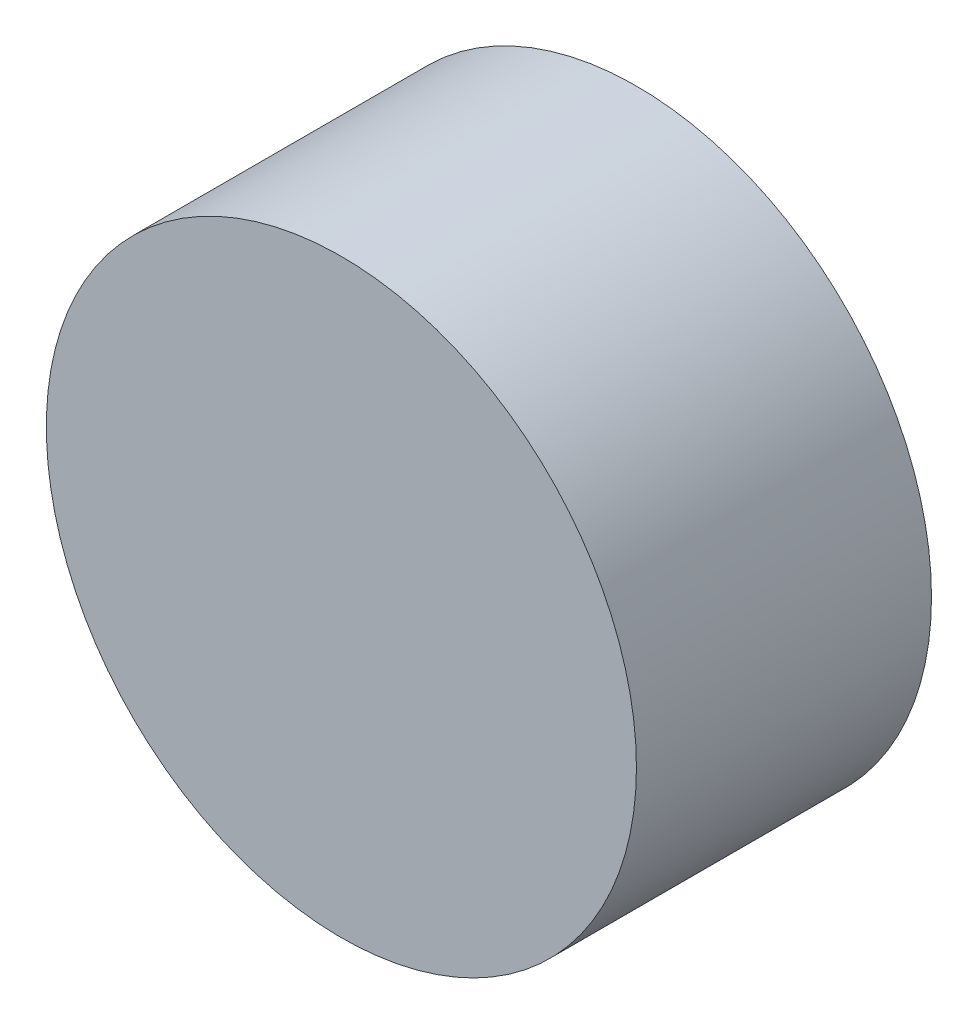
ISO-10303-21;
HEADER;
FILE_DESCRIPTION(('STEP AP214'),'2;1');
FILE_NAME('part.step','',(''),(''),'','','');
FILE_SCHEMA(('AUTOMOTIVE_DESIGN { 1 0 10303 214 1 1 1 1 }'));
ENDSEC;
DATA;
#1=APPLICATION_CONTEXT('core data for automotive mechanical design processes');
#2=APPLICATION_PROTOCOL_DEFINITION('international standard','automotive_design',2000,#1);
#3=PRODUCT_CONTEXT('',#1,'mechanical');
#4=PRODUCT('Part','Part','',(#3));
#5=PRODUCT_RELATED_PRODUCT_CATEGORY('part','',(#4));
#6=PRODUCT_DEFINITION_FORMATION('','',#4);
#7=PRODUCT_DEFINITION_CONTEXT('part definition',#1,'design');
#8=PRODUCT_DEFINITION('design','',#6,#7);
#9=PRODUCT_DEFINITION_SHAPE('','',#8);
#10=(LENGTH_UNIT() NAMED_UNIT(*) SI_UNIT(.MILLI.,.METRE.));
#11=(NAMED_UNIT(*) PLANE_ANGLE_UNIT() SI_UNIT($,.RADIAN.));
#12=(NAMED_UNIT(*) SI_UNIT($,.STERADIAN.) SOLID_ANGLE_UNIT());
#13=UNCERTAINTY_MEASURE_WITH_UNIT(LENGTH_MEASURE(1.E-05),#10,'distance_accuracy_value','');
#14=(GEOMETRIC_REPRESENTATION_CONTEXT(3) GLOBAL_UNCERTAINTY_ASSIGNED_CONTEXT((#13)) GLOBAL_UNIT_ASSIGNED_CONTEXT((#10,
#11,#12)) REPRESENTATION_CONTEXT('',''));
#15=CARTESIAN_POINT('',(0.,0.,0.));
#16=DIRECTION('',(0.,0.,1.));
#17=DIRECTION('',(1.,0.,0.));
#18=AXIS2_PLACEMENT_3D('',#15,#16,#17);
#19=CARTESIAN_POINT('',(0.,0.,6.35));
#20=DIRECTION('',(0.,0.,-1.));
#21=DIRECTION('',(-1.,0.,0.));
#22=AXIS2_PLACEMENT_3D('',#19,#20,#21);
#23=CYLINDRICAL_SURFACE('',#22,6.35);
#24=CARTESIAN_POINT('',(0.,0.,6.35));
#25=DIRECTION('',(0.,0.,1.));
#26=DIRECTION('',(1.,0.,0.));
#27=AXIS2_PLACEMENT_3D('',#24,#25,#26);
#28=CIRCLE('',#27,6.35);
#29=CARTESIAN_POINT('',(6.35,0.,6.35));
#30=VERTEX_POINT('',#29);
#31=EDGE_CURVE('E10',#30,#30,#28,.T.);
#32=ORIENTED_EDGE('',*,*,#31,.F.);
#33=EDGE_LOOP('',(#32));
#34=FACE_BOUND('',#33,.T.);
#35=CARTESIAN_POINT('',(0.,0.,0.));
#36=DIRECTION('',(0.,0.,1.));
#37=DIRECTION('',(1.,0.,0.));
#38=AXIS2_PLACEMENT_3D('',#35,#36,#37);
#39=CIRCLE('',#38,6.35);
#40=CARTESIAN_POINT('',(6.35,0.,0.));
#41=VERTEX_POINT('',#40);
#42=EDGE_CURVE('E18',#41,#41,#39,.T.);
#43=ORIENTED_EDGE('',*,*,#42,.T.);
#44=EDGE_LOOP('',(#43));
#45=FACE_BOUND('',#44,.T.);
#46=ADVANCED_FACE('F15',(#34,#45),#23,.T.);
#47=CARTESIAN_POINT('',(0.,0.,6.35));
#48=DIRECTION('',(0.,0.,1.));
#49=DIRECTION('',(1.,0.,0.));
#50=AXIS2_PLACEMENT_3D('',#47,#48,#49);
#51=PLANE('',#50);
#52=ORIENTED_EDGE('',*,*,#31,.T.);
#53=EDGE_LOOP('',(#52));
#54=FACE_BOUND('',#53,.T.);
#55=ADVANCED_FACE('F30',(#54),#51,.T.);
#56=CARTESIAN_POINT('',(0.,0.,0.));
#57=DIRECTION('',(0.,0.,1.));
#58=DIRECTION('',(1.,0.,0.));
#59=AXIS2_PLACEMENT_3D('',#56,#57,#58);
#60=PLANE('',#59);
#61=ORIENTED_EDGE('',*,*,#42,.F.);
#62=EDGE_LOOP('',(#61));
#63=FACE_BOUND('',#62,.T.);
#64=ADVANCED_FACE('F28',(#63),#60,.F.);
#65=CLOSED_SHELL('',(#46,#55,#64));
#66=MANIFOLD_SOLID_BREP('B1',#65);
#67=ADVANCED_BREP_SHAPE_REPRESENTATION('',(#18,#66),#14);
#68=SHAPE_DEFINITION_REPRESENTATION(#9,#67);
ENDSEC;
END-ISO-10303-21;
